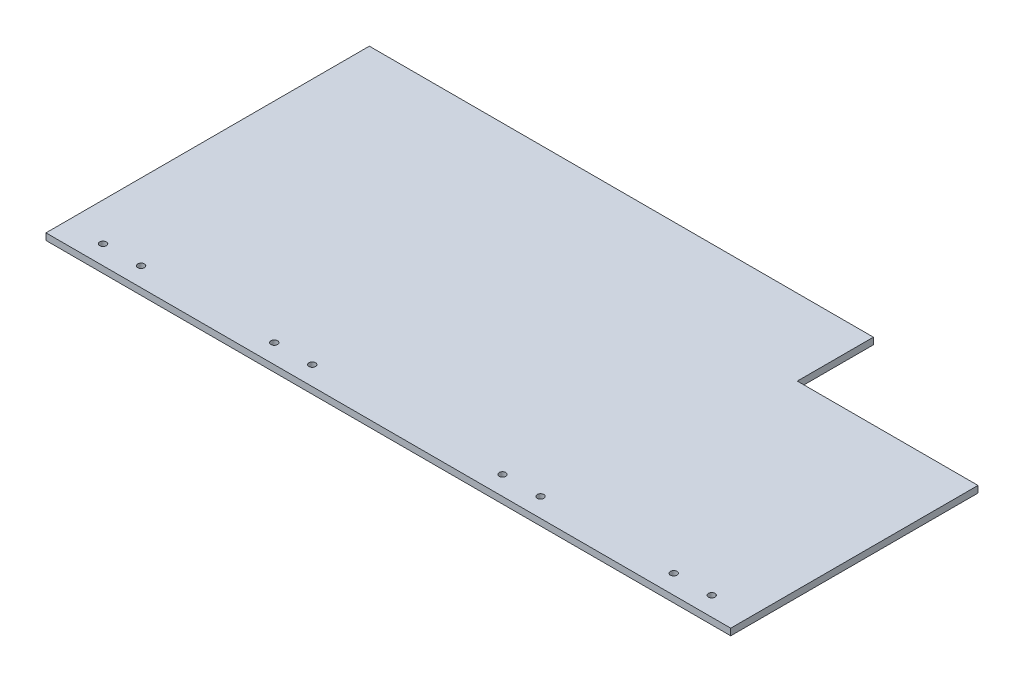
ISO-10303-21;
HEADER;
FILE_DESCRIPTION(('STEP AP214'),'2;1');
FILE_NAME('part.step','',(''),(''),'','','');
FILE_SCHEMA(('AUTOMOTIVE_DESIGN { 1 0 10303 214 1 1 1 1 }'));
ENDSEC;
DATA;
#1=APPLICATION_CONTEXT('core data for automotive mechanical design processes');
#2=APPLICATION_PROTOCOL_DEFINITION('international standard','automotive_design',2000,#1);
#3=PRODUCT_CONTEXT('',#1,'mechanical');
#4=PRODUCT('Part','Part','',(#3));
#5=PRODUCT_RELATED_PRODUCT_CATEGORY('part','',(#4));
#6=PRODUCT_DEFINITION_FORMATION('','',#4);
#7=PRODUCT_DEFINITION_CONTEXT('part definition',#1,'design');
#8=PRODUCT_DEFINITION('design','',#6,#7);
#9=PRODUCT_DEFINITION_SHAPE('','',#8);
#10=(LENGTH_UNIT() NAMED_UNIT(*) SI_UNIT(.MILLI.,.METRE.));
#11=(NAMED_UNIT(*) PLANE_ANGLE_UNIT() SI_UNIT($,.RADIAN.));
#12=(NAMED_UNIT(*) SI_UNIT($,.STERADIAN.) SOLID_ANGLE_UNIT());
#13=UNCERTAINTY_MEASURE_WITH_UNIT(LENGTH_MEASURE(1.E-05),#10,'distance_accuracy_value','');
#14=(GEOMETRIC_REPRESENTATION_CONTEXT(3) GLOBAL_UNCERTAINTY_ASSIGNED_CONTEXT((#13)) GLOBAL_UNIT_ASSIGNED_CONTEXT((#10,
#11,#12)) REPRESENTATION_CONTEXT('',''));
#15=CARTESIAN_POINT('',(0.,0.,0.));
#16=DIRECTION('',(0.,0.,1.));
#17=DIRECTION('',(1.,0.,0.));
#18=AXIS2_PLACEMENT_3D('',#15,#16,#17);
#19=CARTESIAN_POINT('',(0.,3.5,0.));
#20=DIRECTION('',(1.,0.,0.));
#21=DIRECTION('',(0.,0.,-1.));
#22=AXIS2_PLACEMENT_3D('',#19,#20,#21);
#23=PLANE('',#22);
#24=DIRECTION('',(0.,0.,1.));
#25=VECTOR('',#24,1.);
#26=CARTESIAN_POINT('',(0.,0.,0.));
#27=LINE('',#26,#25);
#28=CARTESIAN_POINT('',(0.,0.,-170.));
#29=VERTEX_POINT('',#28);
#30=CARTESIAN_POINT('',(0.,0.,0.));
#31=VERTEX_POINT('',#30);
#32=EDGE_CURVE('E121',#29,#31,#27,.T.);
#33=ORIENTED_EDGE('',*,*,#32,.T.);
#34=DIRECTION('',(0.,-1.,0.));
#35=VECTOR('',#34,1.);
#36=CARTESIAN_POINT('',(0.,3.5,0.));
#37=LINE('',#36,#35);
#38=CARTESIAN_POINT('',(0.,3.5,0.));
#39=VERTEX_POINT('',#38);
#40=EDGE_CURVE('E11',#39,#31,#37,.T.);
#41=ORIENTED_EDGE('',*,*,#40,.F.);
#42=DIRECTION('',(0.,0.,1.));
#43=VECTOR('',#42,1.);
#44=CARTESIAN_POINT('',(0.,3.5,0.));
#45=LINE('',#44,#43);
#46=CARTESIAN_POINT('',(0.,3.5,-170.));
#47=VERTEX_POINT('',#46);
#48=EDGE_CURVE('E119',#47,#39,#45,.T.);
#49=ORIENTED_EDGE('',*,*,#48,.F.);
#50=DIRECTION('',(0.,-1.,0.));
#51=VECTOR('',#50,1.);
#52=CARTESIAN_POINT('',(0.,3.5,-170.));
#53=LINE('',#52,#51);
#54=EDGE_CURVE('E125',#47,#29,#53,.T.);
#55=ORIENTED_EDGE('',*,*,#54,.T.);
#56=EDGE_LOOP('',(#33,#41,#49,#55));
#57=FACE_BOUND('',#56,.T.);
#58=ADVANCED_FACE('F33',(#57),#23,.F.);
#59=CARTESIAN_POINT('',(0.,3.5,0.));
#60=DIRECTION('',(0.,0.,-1.));
#61=DIRECTION('',(-1.,0.,0.));
#62=AXIS2_PLACEMENT_3D('',#59,#60,#61);
#63=PLANE('',#62);
#64=DIRECTION('',(1.,0.,0.));
#65=VECTOR('',#64,1.);
#66=CARTESIAN_POINT('',(0.,0.,0.));
#67=LINE('',#66,#65);
#68=CARTESIAN_POINT('',(360.,0.,0.));
#69=VERTEX_POINT('',#68);
#70=EDGE_CURVE('E117',#31,#69,#67,.T.);
#71=ORIENTED_EDGE('',*,*,#70,.T.);
#72=DIRECTION('',(0.,-1.,0.));
#73=VECTOR('',#72,1.);
#74=CARTESIAN_POINT('',(360.,3.5,0.));
#75=LINE('',#74,#73);
#76=CARTESIAN_POINT('',(360.,3.5,0.));
#77=VERTEX_POINT('',#76);
#78=EDGE_CURVE('E40',#77,#69,#75,.T.);
#79=ORIENTED_EDGE('',*,*,#78,.F.);
#80=DIRECTION('',(1.,0.,0.));
#81=VECTOR('',#80,1.);
#82=CARTESIAN_POINT('',(0.,3.5,0.));
#83=LINE('',#82,#81);
#84=EDGE_CURVE('E79',#39,#77,#83,.T.);
#85=ORIENTED_EDGE('',*,*,#84,.F.);
#86=ORIENTED_EDGE('',*,*,#40,.T.);
#87=EDGE_LOOP('',(#71,#79,#85,#86));
#88=FACE_BOUND('',#87,.T.);
#89=ADVANCED_FACE('F188',(#88),#63,.F.);
#90=CARTESIAN_POINT('',(360.,3.5,0.));
#91=DIRECTION('',(-1.,0.,0.));
#92=DIRECTION('',(0.,0.,1.));
#93=AXIS2_PLACEMENT_3D('',#90,#91,#92);
#94=PLANE('',#93);
#95=DIRECTION('',(0.,0.,-1.));
#96=VECTOR('',#95,1.);
#97=CARTESIAN_POINT('',(360.,0.,0.));
#98=LINE('',#97,#96);
#99=CARTESIAN_POINT('',(360.,0.,-130.));
#100=VERTEX_POINT('',#99);
#101=EDGE_CURVE('E111',#69,#100,#98,.T.);
#102=ORIENTED_EDGE('',*,*,#101,.T.);
#103=DIRECTION('',(0.,1.,0.));
#104=VECTOR('',#103,1.);
#105=CARTESIAN_POINT('',(360.,-0.00100000000000013,-130.));
#106=LINE('',#105,#104);
#107=CARTESIAN_POINT('',(360.,3.5,-130.));
#108=VERTEX_POINT('',#107);
#109=EDGE_CURVE('E94',#100,#108,#106,.T.);
#110=ORIENTED_EDGE('',*,*,#109,.T.);
#111=DIRECTION('',(0.,0.,-1.));
#112=VECTOR('',#111,1.);
#113=CARTESIAN_POINT('',(360.,3.5,0.));
#114=LINE('',#113,#112);
#115=EDGE_CURVE('E130',#77,#108,#114,.T.);
#116=ORIENTED_EDGE('',*,*,#115,.F.);
#117=ORIENTED_EDGE('',*,*,#78,.T.);
#118=EDGE_LOOP('',(#102,#110,#116,#117));
#119=FACE_BOUND('',#118,.T.);
#120=ADVANCED_FACE('F116',(#119),#94,.F.);
#121=CARTESIAN_POINT('',(0.,3.5,-170.));
#122=DIRECTION('',(0.,0.,1.));
#123=DIRECTION('',(1.,0.,0.));
#124=AXIS2_PLACEMENT_3D('',#121,#122,#123);
#125=PLANE('',#124);
#126=DIRECTION('',(-1.,0.,0.));
#127=VECTOR('',#126,1.);
#128=CARTESIAN_POINT('',(0.,3.5,-170.));
#129=LINE('',#128,#127);
#130=CARTESIAN_POINT('',(265.,3.5,-170.));
#131=VERTEX_POINT('',#130);
#132=EDGE_CURVE('E56',#131,#47,#129,.T.);
#133=ORIENTED_EDGE('',*,*,#132,.F.);
#134=DIRECTION('',(0.,1.,0.));
#135=VECTOR('',#134,1.);
#136=CARTESIAN_POINT('',(265.,-0.00100000000000013,-170.));
#137=LINE('',#136,#135);
#138=CARTESIAN_POINT('',(265.,0.,-170.));
#139=VERTEX_POINT('',#138);
#140=EDGE_CURVE('E144',#139,#131,#137,.T.);
#141=ORIENTED_EDGE('',*,*,#140,.F.);
#142=DIRECTION('',(-1.,0.,0.));
#143=VECTOR('',#142,1.);
#144=CARTESIAN_POINT('',(0.,0.,-170.));
#145=LINE('',#144,#143);
#146=EDGE_CURVE('E74',#139,#29,#145,.T.);
#147=ORIENTED_EDGE('',*,*,#146,.T.);
#148=ORIENTED_EDGE('',*,*,#54,.F.);
#149=EDGE_LOOP('',(#133,#141,#147,#148));
#150=FACE_BOUND('',#149,.T.);
#151=ADVANCED_FACE('F197',(#150),#125,.F.);
#152=CARTESIAN_POINT('',(0.,3.5,0.));
#153=DIRECTION('',(0.,-1.,0.));
#154=DIRECTION('',(0.,0.,-1.));
#155=AXIS2_PLACEMENT_3D('',#152,#153,#154);
#156=PLANE('',#155);
#157=CARTESIAN_POINT('',(20.,3.5,-10.));
#158=DIRECTION('',(0.,1.,0.));
#159=DIRECTION('',(0.,0.,1.));
#160=AXIS2_PLACEMENT_3D('',#157,#158,#159);
#161=CIRCLE('',#160,1.75);
#162=CARTESIAN_POINT('',(20.,3.5,-8.25));
#163=VERTEX_POINT('',#162);
#164=EDGE_CURVE('E137',#163,#163,#161,.T.);
#165=ORIENTED_EDGE('',*,*,#164,.F.);
#166=EDGE_LOOP('',(#165));
#167=FACE_BOUND('',#166,.T.);
#168=CARTESIAN_POINT('',(130.,3.5,-10.));
#169=DIRECTION('',(0.,1.,0.));
#170=DIRECTION('',(0.,0.,1.));
#171=AXIS2_PLACEMENT_3D('',#168,#169,#170);
#172=CIRCLE('',#171,1.74999999999998);
#173=CARTESIAN_POINT('',(130.,3.5,-8.25000000000002));
#174=VERTEX_POINT('',#173);
#175=EDGE_CURVE('E157',#174,#174,#172,.T.);
#176=ORIENTED_EDGE('',*,*,#175,.F.);
#177=EDGE_LOOP('',(#176));
#178=FACE_BOUND('',#177,.T.);
#179=CARTESIAN_POINT('',(110.,3.5,-10.));
#180=DIRECTION('',(0.,1.,0.));
#181=DIRECTION('',(0.,0.,1.));
#182=AXIS2_PLACEMENT_3D('',#179,#180,#181);
#183=CIRCLE('',#182,1.75);
#184=CARTESIAN_POINT('',(110.,3.5,-8.25));
#185=VERTEX_POINT('',#184);
#186=EDGE_CURVE('E151',#185,#185,#183,.T.);
#187=ORIENTED_EDGE('',*,*,#186,.F.);
#188=EDGE_LOOP('',(#187));
#189=FACE_BOUND('',#188,.T.);
#190=CARTESIAN_POINT('',(40.,3.5,-10.));
#191=DIRECTION('',(0.,1.,0.));
#192=DIRECTION('',(0.,0.,1.));
#193=AXIS2_PLACEMENT_3D('',#190,#191,#192);
#194=CIRCLE('',#193,1.75);
#195=CARTESIAN_POINT('',(40.,3.5,-8.25));
#196=VERTEX_POINT('',#195);
#197=EDGE_CURVE('E150',#196,#196,#194,.T.);
#198=ORIENTED_EDGE('',*,*,#197,.F.);
#199=EDGE_LOOP('',(#198));
#200=FACE_BOUND('',#199,.T.);
#201=CARTESIAN_POINT('',(230.,3.5,-9.99999999999994));
#202=DIRECTION('',(0.,1.,0.));
#203=DIRECTION('',(0.,0.,-1.));
#204=AXIS2_PLACEMENT_3D('',#201,#202,#203);
#205=CIRCLE('',#204,1.74999999999998);
#206=CARTESIAN_POINT('',(230.,3.5,-11.7499999999999));
#207=VERTEX_POINT('',#206);
#208=EDGE_CURVE('E163',#207,#207,#205,.T.);
#209=ORIENTED_EDGE('',*,*,#208,.F.);
#210=EDGE_LOOP('',(#209));
#211=FACE_BOUND('',#210,.T.);
#212=CARTESIAN_POINT('',(250.,3.5,-9.99999999999989));
#213=DIRECTION('',(0.,1.,0.));
#214=DIRECTION('',(0.,0.,-1.));
#215=AXIS2_PLACEMENT_3D('',#212,#213,#214);
#216=CIRCLE('',#215,1.75000000000001);
#217=CARTESIAN_POINT('',(250.,3.5,-11.7499999999999));
#218=VERTEX_POINT('',#217);
#219=EDGE_CURVE('E173',#218,#218,#216,.T.);
#220=ORIENTED_EDGE('',*,*,#219,.F.);
#221=EDGE_LOOP('',(#220));
#222=FACE_BOUND('',#221,.T.);
#223=CARTESIAN_POINT('',(320.,3.5,-9.99999999999983));
#224=DIRECTION('',(0.,1.,0.));
#225=DIRECTION('',(0.,0.,-1.));
#226=AXIS2_PLACEMENT_3D('',#223,#224,#225);
#227=CIRCLE('',#226,1.74999999999998);
#228=CARTESIAN_POINT('',(320.,3.5,-11.7499999999998));
#229=VERTEX_POINT('',#228);
#230=EDGE_CURVE('E179',#229,#229,#227,.T.);
#231=ORIENTED_EDGE('',*,*,#230,.F.);
#232=EDGE_LOOP('',(#231));
#233=FACE_BOUND('',#232,.T.);
#234=CARTESIAN_POINT('',(340.,3.5,-9.99999999999978));
#235=DIRECTION('',(0.,1.,0.));
#236=DIRECTION('',(0.,0.,-1.));
#237=AXIS2_PLACEMENT_3D('',#234,#235,#236);
#238=CIRCLE('',#237,1.75000000000004);
#239=CARTESIAN_POINT('',(340.,3.5,-11.7499999999998));
#240=VERTEX_POINT('',#239);
#241=EDGE_CURVE('E105',#240,#240,#238,.T.);
#242=ORIENTED_EDGE('',*,*,#241,.F.);
#243=EDGE_LOOP('',(#242));
#244=FACE_BOUND('',#243,.T.);
#245=ORIENTED_EDGE('',*,*,#115,.T.);
#246=DIRECTION('',(1.,0.,0.));
#247=VECTOR('',#246,1.);
#248=CARTESIAN_POINT('',(360.,3.5,-130.));
#249=LINE('',#248,#247);
#250=CARTESIAN_POINT('',(265.,3.5,-130.));
#251=VERTEX_POINT('',#250);
#252=EDGE_CURVE('E100',#251,#108,#249,.T.);
#253=ORIENTED_EDGE('',*,*,#252,.F.);
#254=DIRECTION('',(0.,0.,1.));
#255=VECTOR('',#254,1.);
#256=CARTESIAN_POINT('',(265.,3.5,-170.));
#257=LINE('',#256,#255);
#258=EDGE_CURVE('E113',#131,#251,#257,.T.);
#259=ORIENTED_EDGE('',*,*,#258,.F.);
#260=ORIENTED_EDGE('',*,*,#132,.T.);
#261=ORIENTED_EDGE('',*,*,#48,.T.);
#262=ORIENTED_EDGE('',*,*,#84,.T.);
#263=EDGE_LOOP('',(#245,#253,#259,#260,#261,#262));
#264=FACE_BOUND('',#263,.T.);
#265=ADVANCED_FACE('F187',(#167,#178,#189,#200,#211,#222,#233,#244,#264),#156,.F.);
#266=CARTESIAN_POINT('',(0.,0.,0.));
#267=DIRECTION('',(0.,-1.,0.));
#268=DIRECTION('',(0.,0.,-1.));
#269=AXIS2_PLACEMENT_3D('',#266,#267,#268);
#270=PLANE('',#269);
#271=DIRECTION('',(1.,0.,0.));
#272=VECTOR('',#271,1.);
#273=CARTESIAN_POINT('',(360.,0.,-130.));
#274=LINE('',#273,#272);
#275=CARTESIAN_POINT('',(265.,0.,-130.));
#276=VERTEX_POINT('',#275);
#277=EDGE_CURVE('E97',#276,#100,#274,.T.);
#278=ORIENTED_EDGE('',*,*,#277,.T.);
#279=ORIENTED_EDGE('',*,*,#101,.F.);
#280=ORIENTED_EDGE('',*,*,#70,.F.);
#281=ORIENTED_EDGE('',*,*,#32,.F.);
#282=ORIENTED_EDGE('',*,*,#146,.F.);
#283=DIRECTION('',(0.,0.,1.));
#284=VECTOR('',#283,1.);
#285=CARTESIAN_POINT('',(265.,0.,-170.));
#286=LINE('',#285,#284);
#287=EDGE_CURVE('E112',#139,#276,#286,.T.);
#288=ORIENTED_EDGE('',*,*,#287,.T.);
#289=EDGE_LOOP('',(#278,#279,#280,#281,#282,#288));
#290=FACE_BOUND('',#289,.T.);
#291=CARTESIAN_POINT('',(20.,0.,-10.));
#292=DIRECTION('',(0.,1.,0.));
#293=DIRECTION('',(0.,0.,1.));
#294=AXIS2_PLACEMENT_3D('',#291,#292,#293);
#295=CIRCLE('',#294,1.75);
#296=CARTESIAN_POINT('',(20.,0.,-8.25));
#297=VERTEX_POINT('',#296);
#298=EDGE_CURVE('E134',#297,#297,#295,.T.);
#299=ORIENTED_EDGE('',*,*,#298,.T.);
#300=EDGE_LOOP('',(#299));
#301=FACE_BOUND('',#300,.T.);
#302=CARTESIAN_POINT('',(130.,0.,-10.));
#303=DIRECTION('',(0.,1.,0.));
#304=DIRECTION('',(0.,0.,1.));
#305=AXIS2_PLACEMENT_3D('',#302,#303,#304);
#306=CIRCLE('',#305,1.74999999999998);
#307=CARTESIAN_POINT('',(130.,0.,-8.25000000000002));
#308=VERTEX_POINT('',#307);
#309=EDGE_CURVE('E154',#308,#308,#306,.T.);
#310=ORIENTED_EDGE('',*,*,#309,.T.);
#311=EDGE_LOOP('',(#310));
#312=FACE_BOUND('',#311,.T.);
#313=CARTESIAN_POINT('',(110.,0.,-10.));
#314=DIRECTION('',(0.,1.,0.));
#315=DIRECTION('',(0.,0.,1.));
#316=AXIS2_PLACEMENT_3D('',#313,#314,#315);
#317=CIRCLE('',#316,1.75);
#318=CARTESIAN_POINT('',(110.,0.,-8.25));
#319=VERTEX_POINT('',#318);
#320=EDGE_CURVE('E147',#319,#319,#317,.T.);
#321=ORIENTED_EDGE('',*,*,#320,.T.);
#322=EDGE_LOOP('',(#321));
#323=FACE_BOUND('',#322,.T.);
#324=CARTESIAN_POINT('',(40.,0.,-10.));
#325=DIRECTION('',(0.,1.,0.));
#326=DIRECTION('',(0.,0.,1.));
#327=AXIS2_PLACEMENT_3D('',#324,#325,#326);
#328=CIRCLE('',#327,1.75);
#329=CARTESIAN_POINT('',(40.,0.,-8.25));
#330=VERTEX_POINT('',#329);
#331=EDGE_CURVE('E166',#330,#330,#328,.T.);
#332=ORIENTED_EDGE('',*,*,#331,.T.);
#333=EDGE_LOOP('',(#332));
#334=FACE_BOUND('',#333,.T.);
#335=CARTESIAN_POINT('',(230.,0.,-9.99999999999994));
#336=DIRECTION('',(0.,1.,0.));
#337=DIRECTION('',(0.,0.,-1.));
#338=AXIS2_PLACEMENT_3D('',#335,#336,#337);
#339=CIRCLE('',#338,1.74999999999998);
#340=CARTESIAN_POINT('',(230.,0.,-11.7499999999999));
#341=VERTEX_POINT('',#340);
#342=EDGE_CURVE('E141',#341,#341,#339,.T.);
#343=ORIENTED_EDGE('',*,*,#342,.T.);
#344=EDGE_LOOP('',(#343));
#345=FACE_BOUND('',#344,.T.);
#346=CARTESIAN_POINT('',(250.,0.,-9.99999999999989));
#347=DIRECTION('',(0.,1.,0.));
#348=DIRECTION('',(0.,0.,-1.));
#349=AXIS2_PLACEMENT_3D('',#346,#347,#348);
#350=CIRCLE('',#349,1.75000000000001);
#351=CARTESIAN_POINT('',(250.,0.,-11.7499999999999));
#352=VERTEX_POINT('',#351);
#353=EDGE_CURVE('E160',#352,#352,#350,.T.);
#354=ORIENTED_EDGE('',*,*,#353,.T.);
#355=EDGE_LOOP('',(#354));
#356=FACE_BOUND('',#355,.T.);
#357=CARTESIAN_POINT('',(320.,0.,-9.99999999999983));
#358=DIRECTION('',(0.,1.,0.));
#359=DIRECTION('',(0.,0.,-1.));
#360=AXIS2_PLACEMENT_3D('',#357,#358,#359);
#361=CIRCLE('',#360,1.74999999999998);
#362=CARTESIAN_POINT('',(320.,0.,-11.7499999999998));
#363=VERTEX_POINT('',#362);
#364=EDGE_CURVE('E176',#363,#363,#361,.T.);
#365=ORIENTED_EDGE('',*,*,#364,.T.);
#366=EDGE_LOOP('',(#365));
#367=FACE_BOUND('',#366,.T.);
#368=CARTESIAN_POINT('',(340.,0.,-9.99999999999978));
#369=DIRECTION('',(0.,1.,0.));
#370=DIRECTION('',(0.,0.,-1.));
#371=AXIS2_PLACEMENT_3D('',#368,#369,#370);
#372=CIRCLE('',#371,1.75000000000004);
#373=CARTESIAN_POINT('',(340.,0.,-11.7499999999998));
#374=VERTEX_POINT('',#373);
#375=EDGE_CURVE('E182',#374,#374,#372,.T.);
#376=ORIENTED_EDGE('',*,*,#375,.T.);
#377=EDGE_LOOP('',(#376));
#378=FACE_BOUND('',#377,.T.);
#379=ADVANCED_FACE('F109',(#290,#301,#312,#323,#334,#345,#356,#367,#378),#270,.T.);
#380=CARTESIAN_POINT('',(340.,0.,-9.99999999999978));
#381=DIRECTION('',(0.,1.,0.));
#382=DIRECTION('',(0.,0.,1.));
#383=AXIS2_PLACEMENT_3D('',#380,#381,#382);
#384=CYLINDRICAL_SURFACE('',#383,1.75000000000004);
#385=ORIENTED_EDGE('',*,*,#375,.F.);
#386=EDGE_LOOP('',(#385));
#387=FACE_BOUND('',#386,.T.);
#388=ORIENTED_EDGE('',*,*,#241,.T.);
#389=EDGE_LOOP('',(#388));
#390=FACE_BOUND('',#389,.T.);
#391=ADVANCED_FACE('F204',(#387,#390),#384,.F.);
#392=CARTESIAN_POINT('',(320.,0.,-9.99999999999983));
#393=DIRECTION('',(0.,1.,0.));
#394=DIRECTION('',(0.,0.,1.));
#395=AXIS2_PLACEMENT_3D('',#392,#393,#394);
#396=CYLINDRICAL_SURFACE('',#395,1.74999999999998);
#397=ORIENTED_EDGE('',*,*,#364,.F.);
#398=EDGE_LOOP('',(#397));
#399=FACE_BOUND('',#398,.T.);
#400=ORIENTED_EDGE('',*,*,#230,.T.);
#401=EDGE_LOOP('',(#400));
#402=FACE_BOUND('',#401,.T.);
#403=ADVANCED_FACE('F210',(#399,#402),#396,.F.);
#404=CARTESIAN_POINT('',(250.,0.,-9.99999999999989));
#405=DIRECTION('',(0.,1.,0.));
#406=DIRECTION('',(0.,0.,1.));
#407=AXIS2_PLACEMENT_3D('',#404,#405,#406);
#408=CYLINDRICAL_SURFACE('',#407,1.75000000000001);
#409=ORIENTED_EDGE('',*,*,#353,.F.);
#410=EDGE_LOOP('',(#409));
#411=FACE_BOUND('',#410,.T.);
#412=ORIENTED_EDGE('',*,*,#219,.T.);
#413=EDGE_LOOP('',(#412));
#414=FACE_BOUND('',#413,.T.);
#415=ADVANCED_FACE('F214',(#411,#414),#408,.F.);
#416=CARTESIAN_POINT('',(230.,0.,-9.99999999999994));
#417=DIRECTION('',(0.,1.,0.));
#418=DIRECTION('',(0.,0.,1.));
#419=AXIS2_PLACEMENT_3D('',#416,#417,#418);
#420=CYLINDRICAL_SURFACE('',#419,1.74999999999998);
#421=ORIENTED_EDGE('',*,*,#342,.F.);
#422=EDGE_LOOP('',(#421));
#423=FACE_BOUND('',#422,.T.);
#424=ORIENTED_EDGE('',*,*,#208,.T.);
#425=EDGE_LOOP('',(#424));
#426=FACE_BOUND('',#425,.T.);
#427=ADVANCED_FACE('F218',(#423,#426),#420,.F.);
#428=CARTESIAN_POINT('',(40.,0.,-10.));
#429=DIRECTION('',(0.,1.,0.));
#430=DIRECTION('',(0.,0.,1.));
#431=AXIS2_PLACEMENT_3D('',#428,#429,#430);
#432=CYLINDRICAL_SURFACE('',#431,1.75);
#433=ORIENTED_EDGE('',*,*,#331,.F.);
#434=EDGE_LOOP('',(#433));
#435=FACE_BOUND('',#434,.T.);
#436=ORIENTED_EDGE('',*,*,#197,.T.);
#437=EDGE_LOOP('',(#436));
#438=FACE_BOUND('',#437,.T.);
#439=ADVANCED_FACE('F220',(#435,#438),#432,.F.);
#440=CARTESIAN_POINT('',(110.,0.,-10.));
#441=DIRECTION('',(0.,1.,0.));
#442=DIRECTION('',(0.,0.,1.));
#443=AXIS2_PLACEMENT_3D('',#440,#441,#442);
#444=CYLINDRICAL_SURFACE('',#443,1.75);
#445=ORIENTED_EDGE('',*,*,#320,.F.);
#446=EDGE_LOOP('',(#445));
#447=FACE_BOUND('',#446,.T.);
#448=ORIENTED_EDGE('',*,*,#186,.T.);
#449=EDGE_LOOP('',(#448));
#450=FACE_BOUND('',#449,.T.);
#451=ADVANCED_FACE('F223',(#447,#450),#444,.F.);
#452=CARTESIAN_POINT('',(130.,0.,-10.));
#453=DIRECTION('',(0.,1.,0.));
#454=DIRECTION('',(0.,0.,1.));
#455=AXIS2_PLACEMENT_3D('',#452,#453,#454);
#456=CYLINDRICAL_SURFACE('',#455,1.74999999999998);
#457=ORIENTED_EDGE('',*,*,#309,.F.);
#458=EDGE_LOOP('',(#457));
#459=FACE_BOUND('',#458,.T.);
#460=ORIENTED_EDGE('',*,*,#175,.T.);
#461=EDGE_LOOP('',(#460));
#462=FACE_BOUND('',#461,.T.);
#463=ADVANCED_FACE('F228',(#459,#462),#456,.F.);
#464=CARTESIAN_POINT('',(20.,0.,-10.));
#465=DIRECTION('',(0.,1.,0.));
#466=DIRECTION('',(0.,0.,1.));
#467=AXIS2_PLACEMENT_3D('',#464,#465,#466);
#468=CYLINDRICAL_SURFACE('',#467,1.75);
#469=ORIENTED_EDGE('',*,*,#298,.F.);
#470=EDGE_LOOP('',(#469));
#471=FACE_BOUND('',#470,.T.);
#472=ORIENTED_EDGE('',*,*,#164,.T.);
#473=EDGE_LOOP('',(#472));
#474=FACE_BOUND('',#473,.T.);
#475=ADVANCED_FACE('F231',(#471,#474),#468,.F.);
#476=CARTESIAN_POINT('',(360.,-0.00100000000000013,-130.));
#477=DIRECTION('',(0.,0.,1.));
#478=DIRECTION('',(1.,0.,0.));
#479=AXIS2_PLACEMENT_3D('',#476,#477,#478);
#480=PLANE('',#479);
#481=DIRECTION('',(0.,1.,0.));
#482=VECTOR('',#481,1.);
#483=CARTESIAN_POINT('',(265.,-0.00100000000000013,-130.));
#484=LINE('',#483,#482);
#485=EDGE_CURVE('E47',#276,#251,#484,.T.);
#486=ORIENTED_EDGE('',*,*,#485,.T.);
#487=ORIENTED_EDGE('',*,*,#252,.T.);
#488=ORIENTED_EDGE('',*,*,#109,.F.);
#489=ORIENTED_EDGE('',*,*,#277,.F.);
#490=EDGE_LOOP('',(#486,#487,#488,#489));
#491=FACE_BOUND('',#490,.T.);
#492=ADVANCED_FACE('F96',(#491),#480,.F.);
#493=CARTESIAN_POINT('',(265.,-0.00100000000000013,-170.));
#494=DIRECTION('',(-1.,0.,0.));
#495=DIRECTION('',(0.,0.,1.));
#496=AXIS2_PLACEMENT_3D('',#493,#494,#495);
#497=PLANE('',#496);
#498=ORIENTED_EDGE('',*,*,#140,.T.);
#499=ORIENTED_EDGE('',*,*,#258,.T.);
#500=ORIENTED_EDGE('',*,*,#485,.F.);
#501=ORIENTED_EDGE('',*,*,#287,.F.);
#502=EDGE_LOOP('',(#498,#499,#500,#501));
#503=FACE_BOUND('',#502,.T.);
#504=ADVANCED_FACE('F239',(#503),#497,.F.);
#505=CLOSED_SHELL('',(#58,#89,#120,#151,#265,#379,#391,#403,#415,#427,#439,#451,#463,#475,#492,#504));
#506=MANIFOLD_SOLID_BREP('B2',#505);
#507=ADVANCED_BREP_SHAPE_REPRESENTATION('',(#18,#506),#14);
#508=SHAPE_DEFINITION_REPRESENTATION(#9,#507);
ENDSEC;
END-ISO-10303-21;
